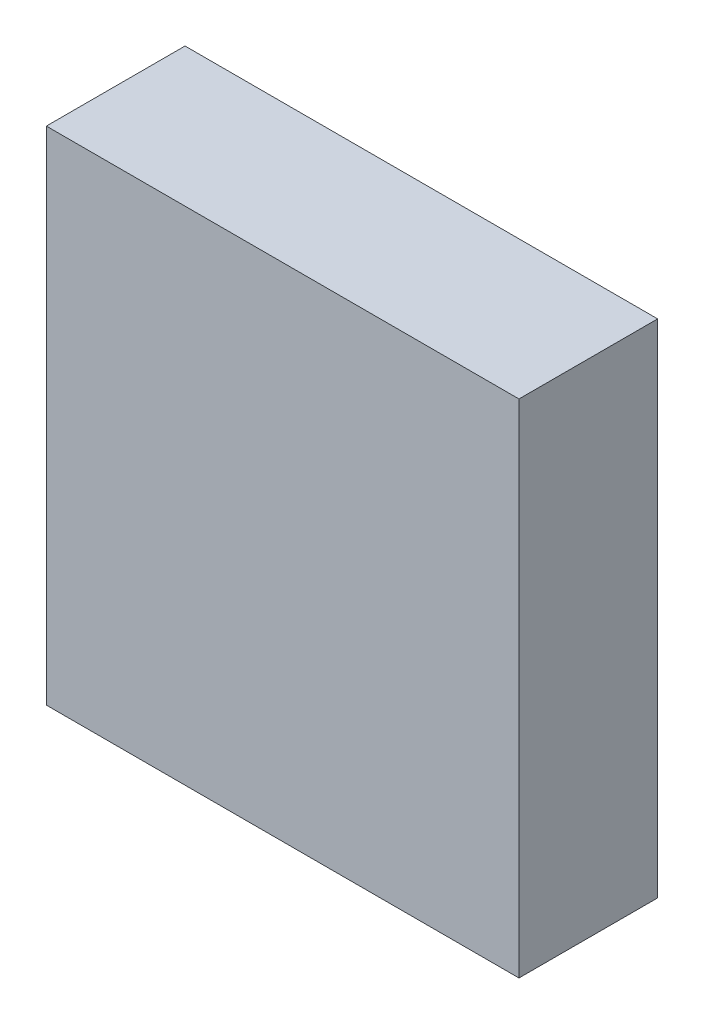
ISO-10303-21;
HEADER;
FILE_DESCRIPTION(('STEP AP214'),'2;1');
FILE_NAME('part.step','',(''),(''),'','','');
FILE_SCHEMA(('AUTOMOTIVE_DESIGN { 1 0 10303 214 1 1 1 1 }'));
ENDSEC;
DATA;
#1=APPLICATION_CONTEXT('core data for automotive mechanical design processes');
#2=APPLICATION_PROTOCOL_DEFINITION('international standard','automotive_design',2000,#1);
#3=PRODUCT_CONTEXT('',#1,'mechanical');
#4=PRODUCT('Part','Part','',(#3));
#5=PRODUCT_RELATED_PRODUCT_CATEGORY('part','',(#4));
#6=PRODUCT_DEFINITION_FORMATION('','',#4);
#7=PRODUCT_DEFINITION_CONTEXT('part definition',#1,'design');
#8=PRODUCT_DEFINITION('design','',#6,#7);
#9=PRODUCT_DEFINITION_SHAPE('','',#8);
#10=(LENGTH_UNIT() NAMED_UNIT(*) SI_UNIT(.MILLI.,.METRE.));
#11=(NAMED_UNIT(*) PLANE_ANGLE_UNIT() SI_UNIT($,.RADIAN.));
#12=(NAMED_UNIT(*) SI_UNIT($,.STERADIAN.) SOLID_ANGLE_UNIT());
#13=UNCERTAINTY_MEASURE_WITH_UNIT(LENGTH_MEASURE(1.E-05),#10,'distance_accuracy_value','');
#14=(GEOMETRIC_REPRESENTATION_CONTEXT(3) GLOBAL_UNCERTAINTY_ASSIGNED_CONTEXT((#13)) GLOBAL_UNIT_ASSIGNED_CONTEXT((#10,
#11,#12)) REPRESENTATION_CONTEXT('',''));
#15=CARTESIAN_POINT('',(0.,0.,0.));
#16=DIRECTION('',(0.,0.,1.));
#17=DIRECTION('',(1.,0.,0.));
#18=AXIS2_PLACEMENT_3D('',#15,#16,#17);
#19=CARTESIAN_POINT('',(-1.704,-1.808,1.));
#20=DIRECTION('',(1.,0.,0.));
#21=DIRECTION('',(0.,0.,-1.));
#22=AXIS2_PLACEMENT_3D('',#19,#20,#21);
#23=PLANE('',#22);
#24=DIRECTION('',(0.,-1.,0.));
#25=VECTOR('',#24,1.);
#26=CARTESIAN_POINT('',(-1.704,-1.808,0.));
#27=LINE('',#26,#25);
#28=CARTESIAN_POINT('',(-1.704,1.808,0.));
#29=VERTEX_POINT('',#28);
#30=CARTESIAN_POINT('',(-1.704,-1.808,0.));
#31=VERTEX_POINT('',#30);
#32=EDGE_CURVE('E95',#29,#31,#27,.T.);
#33=ORIENTED_EDGE('',*,*,#32,.T.);
#34=DIRECTION('',(0.,0.,-1.));
#35=VECTOR('',#34,1.);
#36=CARTESIAN_POINT('',(-1.704,-1.808,1.));
#37=LINE('',#36,#35);
#38=CARTESIAN_POINT('',(-1.704,-1.808,1.));
#39=VERTEX_POINT('',#38);
#40=EDGE_CURVE('E11',#39,#31,#37,.T.);
#41=ORIENTED_EDGE('',*,*,#40,.F.);
#42=DIRECTION('',(0.,-1.,0.));
#43=VECTOR('',#42,1.);
#44=CARTESIAN_POINT('',(-1.704,-1.808,1.));
#45=LINE('',#44,#43);
#46=CARTESIAN_POINT('',(-1.704,1.808,1.));
#47=VERTEX_POINT('',#46);
#48=EDGE_CURVE('E83',#47,#39,#45,.T.);
#49=ORIENTED_EDGE('',*,*,#48,.F.);
#50=DIRECTION('',(0.,0.,-1.));
#51=VECTOR('',#50,1.);
#52=CARTESIAN_POINT('',(-1.704,1.808,1.));
#53=LINE('',#52,#51);
#54=EDGE_CURVE('E91',#47,#29,#53,.T.);
#55=ORIENTED_EDGE('',*,*,#54,.T.);
#56=EDGE_LOOP('',(#33,#41,#49,#55));
#57=FACE_BOUND('',#56,.T.);
#58=ADVANCED_FACE('F32',(#57),#23,.F.);
#59=CARTESIAN_POINT('',(1.704,-1.808,1.));
#60=DIRECTION('',(0.,1.,0.));
#61=DIRECTION('',(0.,0.,1.));
#62=AXIS2_PLACEMENT_3D('',#59,#60,#61);
#63=PLANE('',#62);
#64=DIRECTION('',(1.,0.,0.));
#65=VECTOR('',#64,1.);
#66=CARTESIAN_POINT('',(1.704,-1.808,0.));
#67=LINE('',#66,#65);
#68=CARTESIAN_POINT('',(1.704,-1.808,0.));
#69=VERTEX_POINT('',#68);
#70=EDGE_CURVE('E87',#31,#69,#67,.T.);
#71=ORIENTED_EDGE('',*,*,#70,.T.);
#72=DIRECTION('',(0.,0.,-1.));
#73=VECTOR('',#72,1.);
#74=CARTESIAN_POINT('',(1.704,-1.808,1.));
#75=LINE('',#74,#73);
#76=CARTESIAN_POINT('',(1.704,-1.808,1.));
#77=VERTEX_POINT('',#76);
#78=EDGE_CURVE('E40',#77,#69,#75,.T.);
#79=ORIENTED_EDGE('',*,*,#78,.F.);
#80=DIRECTION('',(1.,0.,0.));
#81=VECTOR('',#80,1.);
#82=CARTESIAN_POINT('',(1.704,-1.808,1.));
#83=LINE('',#82,#81);
#84=EDGE_CURVE('E78',#39,#77,#83,.T.);
#85=ORIENTED_EDGE('',*,*,#84,.F.);
#86=ORIENTED_EDGE('',*,*,#40,.T.);
#87=EDGE_LOOP('',(#71,#79,#85,#86));
#88=FACE_BOUND('',#87,.T.);
#89=ADVANCED_FACE('F86',(#88),#63,.F.);
#90=CARTESIAN_POINT('',(1.704,1.808,1.));
#91=DIRECTION('',(-1.,0.,0.));
#92=DIRECTION('',(0.,0.,1.));
#93=AXIS2_PLACEMENT_3D('',#90,#91,#92);
#94=PLANE('',#93);
#95=DIRECTION('',(0.,1.,0.));
#96=VECTOR('',#95,1.);
#97=CARTESIAN_POINT('',(1.704,1.808,0.));
#98=LINE('',#97,#96);
#99=CARTESIAN_POINT('',(1.704,1.808,0.));
#100=VERTEX_POINT('',#99);
#101=EDGE_CURVE('E65',#69,#100,#98,.T.);
#102=ORIENTED_EDGE('',*,*,#101,.T.);
#103=DIRECTION('',(0.,0.,-1.));
#104=VECTOR('',#103,1.);
#105=CARTESIAN_POINT('',(1.704,1.808,1.));
#106=LINE('',#105,#104);
#107=CARTESIAN_POINT('',(1.704,1.808,1.));
#108=VERTEX_POINT('',#107);
#109=EDGE_CURVE('E88',#108,#100,#106,.T.);
#110=ORIENTED_EDGE('',*,*,#109,.F.);
#111=DIRECTION('',(0.,1.,0.));
#112=VECTOR('',#111,1.);
#113=CARTESIAN_POINT('',(1.704,1.808,1.));
#114=LINE('',#113,#112);
#115=EDGE_CURVE('E81',#77,#108,#114,.T.);
#116=ORIENTED_EDGE('',*,*,#115,.F.);
#117=ORIENTED_EDGE('',*,*,#78,.T.);
#118=EDGE_LOOP('',(#102,#110,#116,#117));
#119=FACE_BOUND('',#118,.T.);
#120=ADVANCED_FACE('F89',(#119),#94,.F.);
#121=CARTESIAN_POINT('',(-1.704,1.808,1.));
#122=DIRECTION('',(0.,-1.,0.));
#123=DIRECTION('',(0.,0.,-1.));
#124=AXIS2_PLACEMENT_3D('',#121,#122,#123);
#125=PLANE('',#124);
#126=DIRECTION('',(-1.,0.,0.));
#127=VECTOR('',#126,1.);
#128=CARTESIAN_POINT('',(-1.704,1.808,0.));
#129=LINE('',#128,#127);
#130=EDGE_CURVE('E71',#100,#29,#129,.T.);
#131=ORIENTED_EDGE('',*,*,#130,.T.);
#132=ORIENTED_EDGE('',*,*,#54,.F.);
#133=DIRECTION('',(-1.,0.,0.));
#134=VECTOR('',#133,1.);
#135=CARTESIAN_POINT('',(-1.704,1.808,1.));
#136=LINE('',#135,#134);
#137=EDGE_CURVE('E48',#108,#47,#136,.T.);
#138=ORIENTED_EDGE('',*,*,#137,.F.);
#139=ORIENTED_EDGE('',*,*,#109,.T.);
#140=EDGE_LOOP('',(#131,#132,#138,#139));
#141=FACE_BOUND('',#140,.T.);
#142=ADVANCED_FACE('F102',(#141),#125,.F.);
#143=CARTESIAN_POINT('',(0.,0.,1.));
#144=DIRECTION('',(0.,0.,-1.));
#145=DIRECTION('',(-1.,0.,0.));
#146=AXIS2_PLACEMENT_3D('',#143,#144,#145);
#147=PLANE('',#146);
#148=ORIENTED_EDGE('',*,*,#48,.T.);
#149=ORIENTED_EDGE('',*,*,#84,.T.);
#150=ORIENTED_EDGE('',*,*,#115,.T.);
#151=ORIENTED_EDGE('',*,*,#137,.T.);
#152=EDGE_LOOP('',(#148,#149,#150,#151));
#153=FACE_BOUND('',#152,.T.);
#154=ADVANCED_FACE('F79',(#153),#147,.F.);
#155=CARTESIAN_POINT('',(0.,0.,0.));
#156=DIRECTION('',(0.,0.,-1.));
#157=DIRECTION('',(-1.,0.,0.));
#158=AXIS2_PLACEMENT_3D('',#155,#156,#157);
#159=PLANE('',#158);
#160=ORIENTED_EDGE('',*,*,#32,.F.);
#161=ORIENTED_EDGE('',*,*,#130,.F.);
#162=ORIENTED_EDGE('',*,*,#101,.F.);
#163=ORIENTED_EDGE('',*,*,#70,.F.);
#164=EDGE_LOOP('',(#160,#161,#162,#163));
#165=FACE_BOUND('',#164,.T.);
#166=ADVANCED_FACE('F105',(#165),#159,.T.);
#167=CLOSED_SHELL('',(#58,#89,#120,#142,#154,#166));
#168=MANIFOLD_SOLID_BREP('B2',#167);
#169=ADVANCED_BREP_SHAPE_REPRESENTATION('',(#18,#168),#14);
#170=SHAPE_DEFINITION_REPRESENTATION(#9,#169);
ENDSEC;
END-ISO-10303-21;
